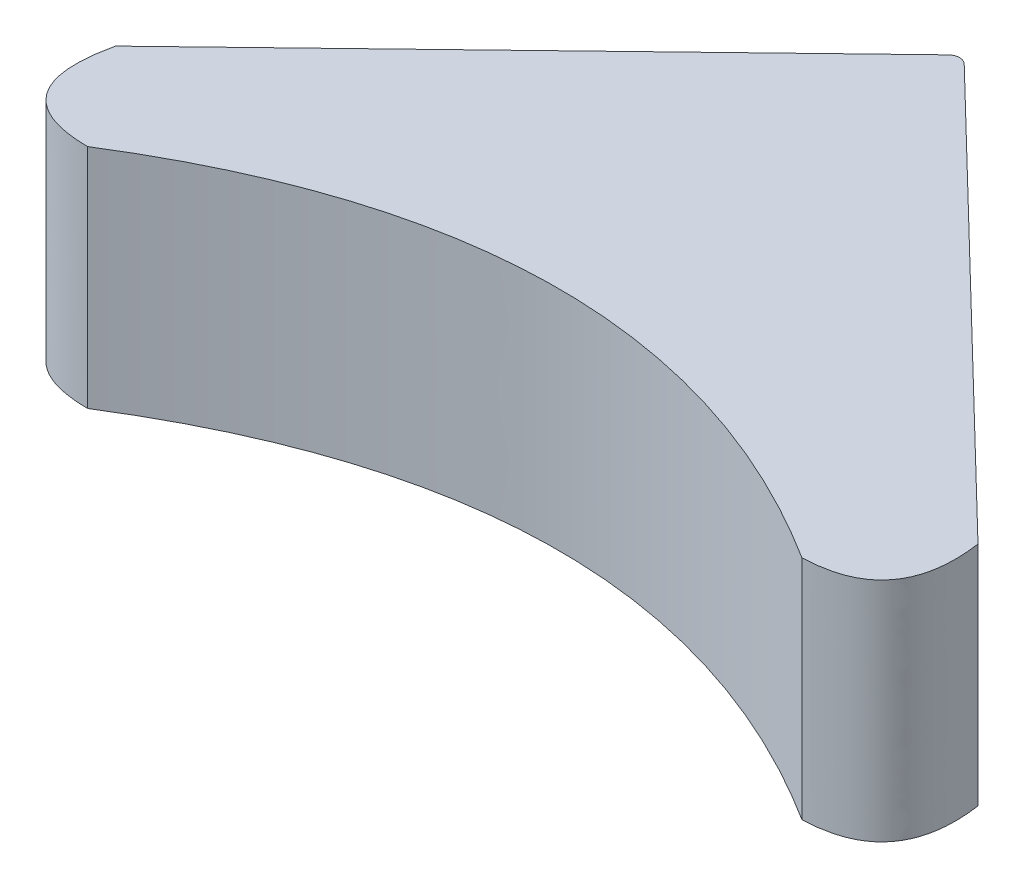
ISO-10303-21;
HEADER;
FILE_DESCRIPTION(('STEP AP214'),'2;1');
FILE_NAME('part.step','',(''),(''),'','','');
FILE_SCHEMA(('AUTOMOTIVE_DESIGN { 1 0 10303 214 1 1 1 1 }'));
ENDSEC;
DATA;
#1=APPLICATION_CONTEXT('core data for automotive mechanical design processes');
#2=APPLICATION_PROTOCOL_DEFINITION('international standard','automotive_design',2000,#1);
#3=PRODUCT_CONTEXT('',#1,'mechanical');
#4=PRODUCT('Part','Part','',(#3));
#5=PRODUCT_RELATED_PRODUCT_CATEGORY('part','',(#4));
#6=PRODUCT_DEFINITION_FORMATION('','',#4);
#7=PRODUCT_DEFINITION_CONTEXT('part definition',#1,'design');
#8=PRODUCT_DEFINITION('design','',#6,#7);
#9=PRODUCT_DEFINITION_SHAPE('','',#8);
#10=(LENGTH_UNIT() NAMED_UNIT(*) SI_UNIT(.MILLI.,.METRE.));
#11=(NAMED_UNIT(*) PLANE_ANGLE_UNIT() SI_UNIT($,.RADIAN.));
#12=(NAMED_UNIT(*) SI_UNIT($,.STERADIAN.) SOLID_ANGLE_UNIT());
#13=UNCERTAINTY_MEASURE_WITH_UNIT(LENGTH_MEASURE(1.E-05),#10,'distance_accuracy_value','');
#14=(GEOMETRIC_REPRESENTATION_CONTEXT(3) GLOBAL_UNCERTAINTY_ASSIGNED_CONTEXT((#13)) GLOBAL_UNIT_ASSIGNED_CONTEXT((#10,
#11,#12)) REPRESENTATION_CONTEXT('',''));
#15=CARTESIAN_POINT('',(0.,0.,0.));
#16=DIRECTION('',(0.,0.,1.));
#17=DIRECTION('',(1.,0.,0.));
#18=AXIS2_PLACEMENT_3D('',#15,#16,#17);
#19=CARTESIAN_POINT('',(235.424177330001,10.,-180.113305170024));
#20=CARTESIAN_POINT('',(239.397471108299,10.,-180.216795460383));
#21=CARTESIAN_POINT('',(238.782263589683,10.,-184.518067666492));
#22=B_SPLINE_CURVE_WITH_KNOTS('',2,(#19,#20,#21),.UNSPECIFIED.,.F.,.F.,(3,3),(0.,1.),.UNSPECIFIED.);
#23=DIRECTION('',(0.,-1.,0.));
#24=VECTOR('',#23,1.);
#25=SURFACE_OF_LINEAR_EXTRUSION('',#22,#24);
#26=CARTESIAN_POINT('',(235.424177330001,0.,-180.113305170024));
#27=CARTESIAN_POINT('',(239.397471108299,0.,-180.216795460383));
#28=CARTESIAN_POINT('',(238.782263589683,0.,-184.518067666492));
#29=B_SPLINE_CURVE_WITH_KNOTS('',2,(#26,#27,#28),.UNSPECIFIED.,.F.,.F.,(3,3),(0.,1.),.UNSPECIFIED.);
#30=CARTESIAN_POINT('',(235.424177330001,0.,-180.113305170024));
#31=VERTEX_POINT('',#30);
#32=CARTESIAN_POINT('',(238.782263589683,0.,-184.518067666492));
#33=VERTEX_POINT('',#32);
#34=EDGE_CURVE('E137',#31,#33,#29,.T.);
#35=ORIENTED_EDGE('',*,*,#34,.T.);
#36=DIRECTION('',(0.,-1.,0.));
#37=VECTOR('',#36,1.);
#38=CARTESIAN_POINT('',(238.782263589683,10.,-184.518067666492));
#39=LINE('',#38,#37);
#40=CARTESIAN_POINT('',(238.782263589683,10.,-184.518067666492));
#41=VERTEX_POINT('',#40);
#42=EDGE_CURVE('E11',#41,#33,#39,.T.);
#43=ORIENTED_EDGE('',*,*,#42,.F.);
#44=CARTESIAN_POINT('',(235.424177330001,10.,-180.113305170024));
#45=VERTEX_POINT('',#44);
#46=EDGE_CURVE('E152',#45,#41,#22,.T.);
#47=ORIENTED_EDGE('',*,*,#46,.F.);
#48=DIRECTION('',(0.,-1.,0.));
#49=VECTOR('',#48,1.);
#50=CARTESIAN_POINT('',(235.424177330001,10.,-180.113305170024));
#51=LINE('',#50,#49);
#52=EDGE_CURVE('E98',#45,#31,#51,.T.);
#53=ORIENTED_EDGE('',*,*,#52,.T.);
#54=EDGE_LOOP('',(#35,#43,#47,#53));
#55=FACE_BOUND('',#54,.T.);
#56=ADVANCED_FACE('F17',(#55),#25,.F.);
#57=CARTESIAN_POINT('',(220.149666464133,10.,-202.542612446011));
#58=DIRECTION('',(-0.69528196299967,0.,0.718737081224648));
#59=DIRECTION('',(0.718737081224648,0.,0.69528196299967));
#60=AXIS2_PLACEMENT_3D('',#57,#58,#59);
#61=PLANE('',#60);
#62=DIRECTION('',(-0.718737081224648,0.,-0.69528196299967));
#63=VECTOR('',#62,1.);
#64=CARTESIAN_POINT('',(220.149666464133,0.,-202.542612446011));
#65=LINE('',#64,#63);
#66=CARTESIAN_POINT('',(220.149666464133,0.,-202.542612446011));
#67=VERTEX_POINT('',#66);
#68=EDGE_CURVE('E129',#33,#67,#65,.T.);
#69=ORIENTED_EDGE('',*,*,#68,.T.);
#70=DIRECTION('',(0.,-1.,0.));
#71=VECTOR('',#70,1.);
#72=CARTESIAN_POINT('',(220.149666464133,10.,-202.542612446011));
#73=LINE('',#72,#71);
#74=CARTESIAN_POINT('',(220.149666464133,10.,-202.542612446011));
#75=VERTEX_POINT('',#74);
#76=EDGE_CURVE('E26',#75,#67,#73,.T.);
#77=ORIENTED_EDGE('',*,*,#76,.F.);
#78=DIRECTION('',(-0.718737081224648,0.,-0.69528196299967));
#79=VECTOR('',#78,1.);
#80=CARTESIAN_POINT('',(220.149666464133,10.,-202.542612446011));
#81=LINE('',#80,#79);
#82=EDGE_CURVE('E71',#41,#75,#81,.T.);
#83=ORIENTED_EDGE('',*,*,#82,.F.);
#84=ORIENTED_EDGE('',*,*,#42,.T.);
#85=EDGE_LOOP('',(#69,#77,#83,#84));
#86=FACE_BOUND('',#85,.T.);
#87=ADVANCED_FACE('F121',(#86),#61,.F.);
#88=CARTESIAN_POINT('',(219.802025482633,10.,-202.183243905398));
#89=DIRECTION('',(0.,-1.,0.));
#90=DIRECTION('',(0.,0.,-1.));
#91=AXIS2_PLACEMENT_3D('',#88,#89,#90);
#92=CYLINDRICAL_SURFACE('',#91,0.499999999999991);
#93=CARTESIAN_POINT('',(219.802025482633,0.,-202.183243905398));
#94=DIRECTION('',(0.,1.,0.));
#95=DIRECTION('',(0.,0.,-1.));
#96=AXIS2_PLACEMENT_3D('',#93,#94,#95);
#97=CIRCLE('',#96,0.499999999999991);
#98=CARTESIAN_POINT('',(219.454981239586,0.,-202.543188753074));
#99=VERTEX_POINT('',#98);
#100=EDGE_CURVE('E136',#67,#99,#97,.T.);
#101=ORIENTED_EDGE('',*,*,#100,.T.);
#102=DIRECTION('',(0.,-1.,0.));
#103=VECTOR('',#102,1.);
#104=CARTESIAN_POINT('',(219.454981239586,10.,-202.543188753074));
#105=LINE('',#104,#103);
#106=CARTESIAN_POINT('',(219.454981239586,10.,-202.543188753074));
#107=VERTEX_POINT('',#106);
#108=EDGE_CURVE('E93',#107,#99,#105,.T.);
#109=ORIENTED_EDGE('',*,*,#108,.F.);
#110=CARTESIAN_POINT('',(219.802025482633,10.,-202.183243905398));
#111=DIRECTION('',(0.,1.,0.));
#112=DIRECTION('',(0.,0.,-1.));
#113=AXIS2_PLACEMENT_3D('',#110,#111,#112);
#114=CIRCLE('',#113,0.499999999999991);
#115=EDGE_CURVE('E84',#75,#107,#114,.T.);
#116=ORIENTED_EDGE('',*,*,#115,.F.);
#117=ORIENTED_EDGE('',*,*,#76,.T.);
#118=EDGE_LOOP('',(#101,#109,#116,#117));
#119=FACE_BOUND('',#118,.T.);
#120=ADVANCED_FACE('F119',(#119),#92,.T.);
#121=CARTESIAN_POINT('',(200.759816015447,10.,-184.518067666492));
#122=DIRECTION('',(0.694088486093286,0.,0.719889695351121));
#123=DIRECTION('',(0.719889695351121,0.,-0.694088486093286));
#124=AXIS2_PLACEMENT_3D('',#121,#122,#123);
#125=PLANE('',#124);
#126=DIRECTION('',(-0.719889695351121,0.,0.694088486093286));
#127=VECTOR('',#126,1.);
#128=CARTESIAN_POINT('',(200.759816015447,0.,-184.518067666492));
#129=LINE('',#128,#127);
#130=CARTESIAN_POINT('',(200.759816015447,0.,-184.518067666492));
#131=VERTEX_POINT('',#130);
#132=EDGE_CURVE('E92',#99,#131,#129,.T.);
#133=ORIENTED_EDGE('',*,*,#132,.T.);
#134=DIRECTION('',(0.,-1.,0.));
#135=VECTOR('',#134,1.);
#136=CARTESIAN_POINT('',(200.759816015447,10.,-184.518067666492));
#137=LINE('',#136,#135);
#138=CARTESIAN_POINT('',(200.759816015447,10.,-184.518067666492));
#139=VERTEX_POINT('',#138);
#140=EDGE_CURVE('E89',#139,#131,#137,.T.);
#141=ORIENTED_EDGE('',*,*,#140,.F.);
#142=DIRECTION('',(-0.719889695351121,0.,0.694088486093286));
#143=VECTOR('',#142,1.);
#144=CARTESIAN_POINT('',(200.759816015447,10.,-184.518067666492));
#145=LINE('',#144,#143);
#146=EDGE_CURVE('E78',#107,#139,#145,.T.);
#147=ORIENTED_EDGE('',*,*,#146,.F.);
#148=ORIENTED_EDGE('',*,*,#108,.T.);
#149=EDGE_LOOP('',(#133,#141,#147,#148));
#150=FACE_BOUND('',#149,.T.);
#151=ADVANCED_FACE('F90',(#150),#125,.F.);
#152=CARTESIAN_POINT('',(200.759816015447,10.,-184.518067666492));
#153=CARTESIAN_POINT('',(199.750797412885,10.,-180.085305789869));
#154=CARTESIAN_POINT('',(203.982228288089,10.,-180.065838880974));
#155=B_SPLINE_CURVE_WITH_KNOTS('',2,(#152,#153,#154),.UNSPECIFIED.,.F.,.F.,(3,3),(0.,1.),.UNSPECIFIED.);
#156=DIRECTION('',(0.,-1.,0.));
#157=VECTOR('',#156,1.);
#158=SURFACE_OF_LINEAR_EXTRUSION('',#155,#157);
#159=CARTESIAN_POINT('',(200.759816015447,0.,-184.518067666492));
#160=CARTESIAN_POINT('',(199.750797412885,0.,-180.085305789869));
#161=CARTESIAN_POINT('',(203.982228288089,0.,-180.065838880974));
#162=B_SPLINE_CURVE_WITH_KNOTS('',2,(#159,#160,#161),.UNSPECIFIED.,.F.,.F.,(3,3),(0.,1.),.UNSPECIFIED.);
#163=CARTESIAN_POINT('',(203.982228288089,0.,-180.065838880974));
#164=VERTEX_POINT('',#163);
#165=EDGE_CURVE('E57',#131,#164,#162,.T.);
#166=ORIENTED_EDGE('',*,*,#165,.T.);
#167=DIRECTION('',(0.,-1.,0.));
#168=VECTOR('',#167,1.);
#169=CARTESIAN_POINT('',(203.982228288089,10.,-180.065838880974));
#170=LINE('',#169,#168);
#171=CARTESIAN_POINT('',(203.982228288089,10.,-180.065838880974));
#172=VERTEX_POINT('',#171);
#173=EDGE_CURVE('E94',#172,#164,#170,.T.);
#174=ORIENTED_EDGE('',*,*,#173,.F.);
#175=EDGE_CURVE('E82',#139,#172,#155,.T.);
#176=ORIENTED_EDGE('',*,*,#175,.F.);
#177=ORIENTED_EDGE('',*,*,#140,.T.);
#178=EDGE_LOOP('',(#166,#174,#176,#177));
#179=FACE_BOUND('',#178,.T.);
#180=ADVANCED_FACE('F96',(#179),#158,.F.);
#181=CARTESIAN_POINT('',(203.982228288089,10.,-180.065838880974));
#182=CARTESIAN_POINT('',(219.79769352251,10.,-189.968104106239));
#183=CARTESIAN_POINT('',(235.424177330001,10.,-180.113305170024));
#184=B_SPLINE_CURVE_WITH_KNOTS('',2,(#181,#182,#183),.UNSPECIFIED.,.F.,.F.,(3,3),(0.,1.),.UNSPECIFIED.);
#185=DIRECTION('',(0.,-1.,0.));
#186=VECTOR('',#185,1.);
#187=SURFACE_OF_LINEAR_EXTRUSION('',#184,#186);
#188=CARTESIAN_POINT('',(203.982228288089,0.,-180.065838880974));
#189=CARTESIAN_POINT('',(219.79769352251,0.,-189.968104106239));
#190=CARTESIAN_POINT('',(235.424177330001,0.,-180.113305170024));
#191=B_SPLINE_CURVE_WITH_KNOTS('',2,(#188,#189,#190),.UNSPECIFIED.,.F.,.F.,(3,3),(0.,1.),.UNSPECIFIED.);
#192=EDGE_CURVE('E63',#164,#31,#191,.T.);
#193=ORIENTED_EDGE('',*,*,#192,.T.);
#194=ORIENTED_EDGE('',*,*,#52,.F.);
#195=EDGE_CURVE('E34',#172,#45,#184,.T.);
#196=ORIENTED_EDGE('',*,*,#195,.F.);
#197=ORIENTED_EDGE('',*,*,#173,.T.);
#198=EDGE_LOOP('',(#193,#194,#196,#197));
#199=FACE_BOUND('',#198,.T.);
#200=ADVANCED_FACE('F115',(#199),#187,.F.);
#201=CARTESIAN_POINT('',(238.250345784071,10.,-181.26624093932));
#202=DIRECTION('',(0.,-1.,0.));
#203=DIRECTION('',(0.,0.,-1.));
#204=AXIS2_PLACEMENT_3D('',#201,#202,#203);
#205=PLANE('',#204);
#206=ORIENTED_EDGE('',*,*,#46,.T.);
#207=ORIENTED_EDGE('',*,*,#82,.T.);
#208=ORIENTED_EDGE('',*,*,#115,.T.);
#209=ORIENTED_EDGE('',*,*,#146,.T.);
#210=ORIENTED_EDGE('',*,*,#175,.T.);
#211=ORIENTED_EDGE('',*,*,#195,.T.);
#212=EDGE_LOOP('',(#206,#207,#208,#209,#210,#211));
#213=FACE_BOUND('',#212,.T.);
#214=ADVANCED_FACE('F80',(#213),#205,.F.);
#215=CARTESIAN_POINT('',(238.250345784071,0.,-181.26624093932));
#216=DIRECTION('',(0.,-1.,0.));
#217=DIRECTION('',(0.,0.,-1.));
#218=AXIS2_PLACEMENT_3D('',#215,#216,#217);
#219=PLANE('',#218);
#220=ORIENTED_EDGE('',*,*,#34,.F.);
#221=ORIENTED_EDGE('',*,*,#192,.F.);
#222=ORIENTED_EDGE('',*,*,#165,.F.);
#223=ORIENTED_EDGE('',*,*,#132,.F.);
#224=ORIENTED_EDGE('',*,*,#100,.F.);
#225=ORIENTED_EDGE('',*,*,#68,.F.);
#226=EDGE_LOOP('',(#220,#221,#222,#223,#224,#225));
#227=FACE_BOUND('',#226,.T.);
#228=ADVANCED_FACE('F139',(#227),#219,.T.);
#229=CLOSED_SHELL('',(#56,#87,#120,#151,#180,#200,#214,#228));
#230=MANIFOLD_SOLID_BREP('B1',#229);
#231=ADVANCED_BREP_SHAPE_REPRESENTATION('',(#18,#230),#14);
#232=SHAPE_DEFINITION_REPRESENTATION(#9,#231);
ENDSEC;
END-ISO-10303-21;
